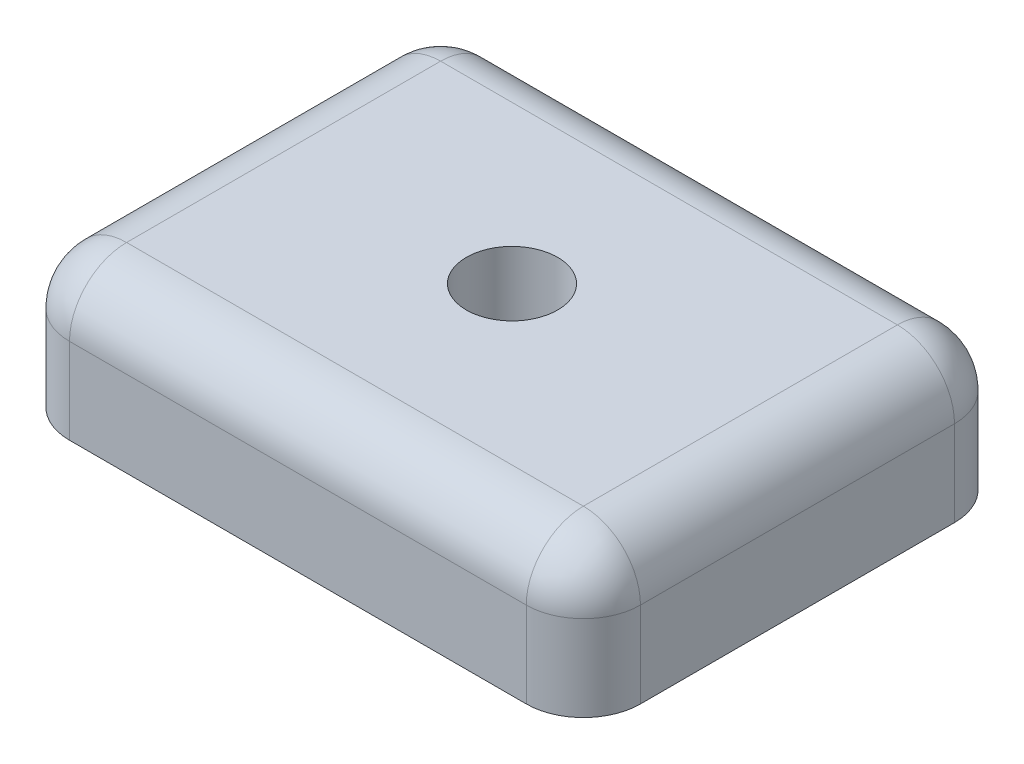
ISO-10303-21;
HEADER;
FILE_DESCRIPTION(('STEP AP214'),'2;1');
FILE_NAME('part.step','',(''),(''),'','','');
FILE_SCHEMA(('AUTOMOTIVE_DESIGN { 1 0 10303 214 1 1 1 1 }'));
ENDSEC;
DATA;
#1=APPLICATION_CONTEXT('core data for automotive mechanical design processes');
#2=APPLICATION_PROTOCOL_DEFINITION('international standard','automotive_design',2000,#1);
#3=PRODUCT_CONTEXT('',#1,'mechanical');
#4=PRODUCT('Part','Part','',(#3));
#5=PRODUCT_RELATED_PRODUCT_CATEGORY('part','',(#4));
#6=PRODUCT_DEFINITION_FORMATION('','',#4);
#7=PRODUCT_DEFINITION_CONTEXT('part definition',#1,'design');
#8=PRODUCT_DEFINITION('design','',#6,#7);
#9=PRODUCT_DEFINITION_SHAPE('','',#8);
#10=(LENGTH_UNIT() NAMED_UNIT(*) SI_UNIT(.MILLI.,.METRE.));
#11=(NAMED_UNIT(*) PLANE_ANGLE_UNIT() SI_UNIT($,.RADIAN.));
#12=(NAMED_UNIT(*) SI_UNIT($,.STERADIAN.) SOLID_ANGLE_UNIT());
#13=UNCERTAINTY_MEASURE_WITH_UNIT(LENGTH_MEASURE(1.E-05),#10,'distance_accuracy_value','');
#14=(GEOMETRIC_REPRESENTATION_CONTEXT(3) GLOBAL_UNCERTAINTY_ASSIGNED_CONTEXT((#13)) GLOBAL_UNIT_ASSIGNED_CONTEXT((#10,
#11,#12)) REPRESENTATION_CONTEXT('',''));
#15=CARTESIAN_POINT('',(0.,0.,0.));
#16=DIRECTION('',(0.,0.,1.));
#17=DIRECTION('',(1.,0.,0.));
#18=AXIS2_PLACEMENT_3D('',#15,#16,#17);
#19=CARTESIAN_POINT('',(0.,5.,0.));
#20=DIRECTION('',(0.,0.,-1.));
#21=DIRECTION('',(-1.,0.,0.));
#22=AXIS2_PLACEMENT_3D('',#19,#20,#21);
#23=PLANE('',#22);
#24=DIRECTION('',(1.,0.,0.));
#25=VECTOR('',#24,1.);
#26=CARTESIAN_POINT('',(0.,0.,0.));
#27=LINE('',#26,#25);
#28=CARTESIAN_POINT('',(2.,0.,0.));
#29=VERTEX_POINT('',#28);
#30=CARTESIAN_POINT('',(18.,0.,0.));
#31=VERTEX_POINT('',#30);
#32=EDGE_CURVE('E117',#29,#31,#27,.T.);
#33=ORIENTED_EDGE('',*,*,#32,.T.);
#34=DIRECTION('',(0.,-1.,0.));
#35=VECTOR('',#34,1.);
#36=CARTESIAN_POINT('',(18.,5.,0.));
#37=LINE('',#36,#35);
#38=CARTESIAN_POINT('',(18.,3.,0.));
#39=VERTEX_POINT('',#38);
#40=EDGE_CURVE('E162',#31,#39,#37,.F.);
#41=ORIENTED_EDGE('',*,*,#40,.T.);
#42=DIRECTION('',(1.,0.,0.));
#43=VECTOR('',#42,1.);
#44=CARTESIAN_POINT('',(0.,3.,0.));
#45=LINE('',#44,#43);
#46=CARTESIAN_POINT('',(2.,3.,0.));
#47=VERTEX_POINT('',#46);
#48=EDGE_CURVE('E158',#39,#47,#45,.F.);
#49=ORIENTED_EDGE('',*,*,#48,.T.);
#50=DIRECTION('',(0.,-1.,0.));
#51=VECTOR('',#50,1.);
#52=CARTESIAN_POINT('',(2.,0.,0.));
#53=LINE('',#52,#51);
#54=EDGE_CURVE('E160',#47,#29,#53,.T.);
#55=ORIENTED_EDGE('',*,*,#54,.T.);
#56=EDGE_LOOP('',(#33,#41,#49,#55));
#57=FACE_BOUND('',#56,.T.);
#58=ADVANCED_FACE('F35',(#57),#23,.F.);
#59=CARTESIAN_POINT('',(20.,5.,0.));
#60=DIRECTION('',(-1.,0.,0.));
#61=DIRECTION('',(0.,0.,1.));
#62=AXIS2_PLACEMENT_3D('',#59,#60,#61);
#63=PLANE('',#62);
#64=DIRECTION('',(0.,0.,-1.));
#65=VECTOR('',#64,1.);
#66=CARTESIAN_POINT('',(20.,0.,0.));
#67=LINE('',#66,#65);
#68=CARTESIAN_POINT('',(20.,0.,-2.));
#69=VERTEX_POINT('',#68);
#70=CARTESIAN_POINT('',(20.,0.,-13.));
#71=VERTEX_POINT('',#70);
#72=EDGE_CURVE('E212',#69,#71,#67,.T.);
#73=ORIENTED_EDGE('',*,*,#72,.T.);
#74=DIRECTION('',(0.,-1.,0.));
#75=VECTOR('',#74,1.);
#76=CARTESIAN_POINT('',(20.,5.,-13.));
#77=LINE('',#76,#75);
#78=CARTESIAN_POINT('',(20.,3.,-13.));
#79=VERTEX_POINT('',#78);
#80=EDGE_CURVE('E156',#71,#79,#77,.F.);
#81=ORIENTED_EDGE('',*,*,#80,.T.);
#82=DIRECTION('',(0.,0.,-1.));
#83=VECTOR('',#82,1.);
#84=CARTESIAN_POINT('',(20.,3.,0.));
#85=LINE('',#84,#83);
#86=CARTESIAN_POINT('',(20.,3.,-2.));
#87=VERTEX_POINT('',#86);
#88=EDGE_CURVE('E152',#79,#87,#85,.F.);
#89=ORIENTED_EDGE('',*,*,#88,.T.);
#90=DIRECTION('',(0.,-1.,0.));
#91=VECTOR('',#90,1.);
#92=CARTESIAN_POINT('',(20.,5.,-2.));
#93=LINE('',#92,#91);
#94=EDGE_CURVE('E154',#87,#69,#93,.T.);
#95=ORIENTED_EDGE('',*,*,#94,.T.);
#96=EDGE_LOOP('',(#73,#81,#89,#95));
#97=FACE_BOUND('',#96,.T.);
#98=ADVANCED_FACE('F227',(#97),#63,.F.);
#99=CARTESIAN_POINT('',(0.,5.,-15.));
#100=DIRECTION('',(0.,0.,-1.));
#101=DIRECTION('',(-1.,0.,0.));
#102=AXIS2_PLACEMENT_3D('',#99,#100,#101);
#103=PLANE('',#102);
#104=DIRECTION('',(1.,0.,0.));
#105=VECTOR('',#104,1.);
#106=CARTESIAN_POINT('',(0.,0.,-15.));
#107=LINE('',#106,#105);
#108=CARTESIAN_POINT('',(2.,0.,-15.));
#109=VERTEX_POINT('',#108);
#110=CARTESIAN_POINT('',(18.,0.,-15.));
#111=VERTEX_POINT('',#110);
#112=EDGE_CURVE('E131',#109,#111,#107,.T.);
#113=ORIENTED_EDGE('',*,*,#112,.F.);
#114=DIRECTION('',(0.,-1.,0.));
#115=VECTOR('',#114,1.);
#116=CARTESIAN_POINT('',(2.,5.,-15.));
#117=LINE('',#116,#115);
#118=CARTESIAN_POINT('',(2.,3.,-15.));
#119=VERTEX_POINT('',#118);
#120=EDGE_CURVE('E150',#109,#119,#117,.F.);
#121=ORIENTED_EDGE('',*,*,#120,.T.);
#122=DIRECTION('',(1.,0.,0.));
#123=VECTOR('',#122,1.);
#124=CARTESIAN_POINT('',(0.,3.,-15.));
#125=LINE('',#124,#123);
#126=CARTESIAN_POINT('',(18.,3.,-15.));
#127=VERTEX_POINT('',#126);
#128=EDGE_CURVE('E146',#119,#127,#125,.T.);
#129=ORIENTED_EDGE('',*,*,#128,.T.);
#130=DIRECTION('',(0.,-1.,0.));
#131=VECTOR('',#130,1.);
#132=CARTESIAN_POINT('',(18.,0.,-15.));
#133=LINE('',#132,#131);
#134=EDGE_CURVE('E148',#127,#111,#133,.T.);
#135=ORIENTED_EDGE('',*,*,#134,.T.);
#136=EDGE_LOOP('',(#113,#121,#129,#135));
#137=FACE_BOUND('',#136,.T.);
#138=ADVANCED_FACE('F268',(#137),#103,.T.);
#139=CARTESIAN_POINT('',(0.,5.,0.));
#140=DIRECTION('',(-1.,0.,0.));
#141=DIRECTION('',(0.,0.,1.));
#142=AXIS2_PLACEMENT_3D('',#139,#140,#141);
#143=PLANE('',#142);
#144=DIRECTION('',(0.,0.,-1.));
#145=VECTOR('',#144,1.);
#146=CARTESIAN_POINT('',(0.,3.,0.));
#147=LINE('',#146,#145);
#148=CARTESIAN_POINT('',(0.,3.,-2.));
#149=VERTEX_POINT('',#148);
#150=CARTESIAN_POINT('',(0.,3.,-13.));
#151=VERTEX_POINT('',#150);
#152=EDGE_CURVE('E130',#149,#151,#147,.T.);
#153=ORIENTED_EDGE('',*,*,#152,.T.);
#154=DIRECTION('',(0.,-1.,0.));
#155=VECTOR('',#154,1.);
#156=CARTESIAN_POINT('',(0.,5.,-13.));
#157=LINE('',#156,#155);
#158=CARTESIAN_POINT('',(0.,0.,-13.));
#159=VERTEX_POINT('',#158);
#160=EDGE_CURVE('E122',#151,#159,#157,.T.);
#161=ORIENTED_EDGE('',*,*,#160,.T.);
#162=DIRECTION('',(0.,0.,-1.));
#163=VECTOR('',#162,1.);
#164=CARTESIAN_POINT('',(0.,0.,0.));
#165=LINE('',#164,#163);
#166=CARTESIAN_POINT('',(0.,0.,-2.));
#167=VERTEX_POINT('',#166);
#168=EDGE_CURVE('E115',#167,#159,#165,.T.);
#169=ORIENTED_EDGE('',*,*,#168,.F.);
#170=DIRECTION('',(0.,-1.,0.));
#171=VECTOR('',#170,1.);
#172=CARTESIAN_POINT('',(0.,5.,-2.));
#173=LINE('',#172,#171);
#174=EDGE_CURVE('E127',#167,#149,#173,.F.);
#175=ORIENTED_EDGE('',*,*,#174,.T.);
#176=EDGE_LOOP('',(#153,#161,#169,#175));
#177=FACE_BOUND('',#176,.T.);
#178=ADVANCED_FACE('F126',(#177),#143,.T.);
#179=CARTESIAN_POINT('',(0.,5.,0.));
#180=DIRECTION('',(0.,1.,0.));
#181=DIRECTION('',(0.,0.,1.));
#182=AXIS2_PLACEMENT_3D('',#179,#180,#181);
#183=PLANE('',#182);
#184=DIRECTION('',(0.,0.,-1.));
#185=VECTOR('',#184,1.);
#186=CARTESIAN_POINT('',(2.,5.,0.));
#187=LINE('',#186,#185);
#188=CARTESIAN_POINT('',(2.,5.,-13.));
#189=VERTEX_POINT('',#188);
#190=CARTESIAN_POINT('',(2.,5.,-2.));
#191=VERTEX_POINT('',#190);
#192=EDGE_CURVE('E164',#189,#191,#187,.F.);
#193=ORIENTED_EDGE('',*,*,#192,.T.);
#194=DIRECTION('',(1.,0.,0.));
#195=VECTOR('',#194,1.);
#196=CARTESIAN_POINT('',(20.,5.,-2.));
#197=LINE('',#196,#195);
#198=CARTESIAN_POINT('',(18.,5.,-2.));
#199=VERTEX_POINT('',#198);
#200=EDGE_CURVE('E11',#191,#199,#197,.T.);
#201=ORIENTED_EDGE('',*,*,#200,.T.);
#202=DIRECTION('',(0.,0.,-1.));
#203=VECTOR('',#202,1.);
#204=CARTESIAN_POINT('',(18.,5.,-15.));
#205=LINE('',#204,#203);
#206=CARTESIAN_POINT('',(18.,5.,-13.));
#207=VERTEX_POINT('',#206);
#208=EDGE_CURVE('E44',#199,#207,#205,.T.);
#209=ORIENTED_EDGE('',*,*,#208,.T.);
#210=DIRECTION('',(1.,0.,0.));
#211=VECTOR('',#210,1.);
#212=CARTESIAN_POINT('',(0.,5.,-13.));
#213=LINE('',#212,#211);
#214=EDGE_CURVE('E166',#207,#189,#213,.F.);
#215=ORIENTED_EDGE('',*,*,#214,.T.);
#216=EDGE_LOOP('',(#193,#201,#209,#215));
#217=FACE_BOUND('',#216,.T.);
#218=CARTESIAN_POINT('',(10.,5.,-7.5));
#219=DIRECTION('',(0.,1.,0.));
#220=DIRECTION('',(0.,0.,1.));
#221=AXIS2_PLACEMENT_3D('',#218,#219,#220);
#222=CIRCLE('',#221,1.6);
#223=CARTESIAN_POINT('',(10.,5.,-5.9));
#224=VERTEX_POINT('',#223);
#225=EDGE_CURVE('E199',#224,#224,#222,.T.);
#226=ORIENTED_EDGE('',*,*,#225,.F.);
#227=EDGE_LOOP('',(#226));
#228=FACE_BOUND('',#227,.T.);
#229=ADVANCED_FACE('F239',(#217,#228),#183,.T.);
#230=CARTESIAN_POINT('',(0.,0.,0.));
#231=DIRECTION('',(0.,1.,0.));
#232=DIRECTION('',(0.,0.,1.));
#233=AXIS2_PLACEMENT_3D('',#230,#231,#232);
#234=PLANE('',#233);
#235=CARTESIAN_POINT('',(10.,0.,-7.5));
#236=DIRECTION('',(0.,1.,0.));
#237=DIRECTION('',(0.,0.,1.));
#238=AXIS2_PLACEMENT_3D('',#235,#236,#237);
#239=CIRCLE('',#238,1.6);
#240=CARTESIAN_POINT('',(10.,0.,-5.9));
#241=VERTEX_POINT('',#240);
#242=EDGE_CURVE('E204',#241,#241,#239,.T.);
#243=ORIENTED_EDGE('',*,*,#242,.T.);
#244=EDGE_LOOP('',(#243));
#245=FACE_BOUND('',#244,.T.);
#246=ORIENTED_EDGE('',*,*,#168,.T.);
#247=CARTESIAN_POINT('',(2.,0.,-13.));
#248=DIRECTION('',(0.,1.,0.));
#249=DIRECTION('',(0.,0.,1.));
#250=AXIS2_PLACEMENT_3D('',#247,#248,#249);
#251=CIRCLE('',#250,2.);
#252=EDGE_CURVE('E144',#159,#109,#251,.F.);
#253=ORIENTED_EDGE('',*,*,#252,.T.);
#254=ORIENTED_EDGE('',*,*,#112,.T.);
#255=CARTESIAN_POINT('',(18.,0.,-13.));
#256=DIRECTION('',(0.,1.,0.));
#257=DIRECTION('',(0.,0.,1.));
#258=AXIS2_PLACEMENT_3D('',#255,#256,#257);
#259=CIRCLE('',#258,2.);
#260=EDGE_CURVE('E142',#111,#71,#259,.F.);
#261=ORIENTED_EDGE('',*,*,#260,.T.);
#262=ORIENTED_EDGE('',*,*,#72,.F.);
#263=CARTESIAN_POINT('',(18.,0.,-2.));
#264=DIRECTION('',(0.,1.,0.));
#265=DIRECTION('',(0.,0.,1.));
#266=AXIS2_PLACEMENT_3D('',#263,#264,#265);
#267=CIRCLE('',#266,2.);
#268=EDGE_CURVE('E121',#69,#31,#267,.F.);
#269=ORIENTED_EDGE('',*,*,#268,.T.);
#270=ORIENTED_EDGE('',*,*,#32,.F.);
#271=CARTESIAN_POINT('',(2.,0.,-2.));
#272=DIRECTION('',(0.,1.,0.));
#273=DIRECTION('',(0.,0.,1.));
#274=AXIS2_PLACEMENT_3D('',#271,#272,#273);
#275=CIRCLE('',#274,2.);
#276=EDGE_CURVE('E112',#29,#167,#275,.F.);
#277=ORIENTED_EDGE('',*,*,#276,.T.);
#278=EDGE_LOOP('',(#246,#253,#254,#261,#262,#269,#270,#277));
#279=FACE_BOUND('',#278,.T.);
#280=ADVANCED_FACE('F114',(#245,#279),#234,.F.);
#281=CARTESIAN_POINT('',(10.,0.,-7.5));
#282=DIRECTION('',(0.,1.,0.));
#283=DIRECTION('',(0.,0.,1.));
#284=AXIS2_PLACEMENT_3D('',#281,#282,#283);
#285=CYLINDRICAL_SURFACE('',#284,1.6);
#286=ORIENTED_EDGE('',*,*,#242,.F.);
#287=EDGE_LOOP('',(#286));
#288=FACE_BOUND('',#287,.T.);
#289=ORIENTED_EDGE('',*,*,#225,.T.);
#290=EDGE_LOOP('',(#289));
#291=FACE_BOUND('',#290,.T.);
#292=ADVANCED_FACE('F260',(#288,#291),#285,.F.);
#293=CARTESIAN_POINT('',(18.,5.,-2.));
#294=DIRECTION('',(0.,-1.,0.));
#295=DIRECTION('',(0.,0.,-1.));
#296=AXIS2_PLACEMENT_3D('',#293,#294,#295);
#297=CYLINDRICAL_SURFACE('',#296,2.);
#298=CARTESIAN_POINT('',(18.,3.,-2.));
#299=DIRECTION('',(0.,1.,0.));
#300=DIRECTION('',(0.,0.,1.));
#301=AXIS2_PLACEMENT_3D('',#298,#299,#300);
#302=CIRCLE('',#301,2.);
#303=EDGE_CURVE('E39',#39,#87,#302,.T.);
#304=ORIENTED_EDGE('',*,*,#303,.F.);
#305=ORIENTED_EDGE('',*,*,#40,.F.);
#306=ORIENTED_EDGE('',*,*,#268,.F.);
#307=ORIENTED_EDGE('',*,*,#94,.F.);
#308=EDGE_LOOP('',(#304,#305,#306,#307));
#309=FACE_BOUND('',#308,.T.);
#310=ADVANCED_FACE('F37',(#309),#297,.T.);
#311=CARTESIAN_POINT('',(18.,3.,-2.));
#312=DIRECTION('',(1.,0.,0.));
#313=DIRECTION('',(0.,0.,-1.));
#314=AXIS2_PLACEMENT_3D('',#311,#312,#313);
#315=SPHERICAL_SURFACE('',#314,2.);
#316=CARTESIAN_POINT('',(18.,3.,-2.));
#317=DIRECTION('',(1.,0.,0.));
#318=DIRECTION('',(0.,0.,-1.));
#319=AXIS2_PLACEMENT_3D('',#316,#317,#318);
#320=CIRCLE('',#319,2.);
#321=EDGE_CURVE('E194',#39,#199,#320,.F.);
#322=ORIENTED_EDGE('',*,*,#321,.F.);
#323=ORIENTED_EDGE('',*,*,#303,.T.);
#324=CARTESIAN_POINT('',(18.,3.,-2.));
#325=DIRECTION('',(0.,0.,1.));
#326=DIRECTION('',(0.,-1.,0.));
#327=AXIS2_PLACEMENT_3D('',#324,#325,#326);
#328=CIRCLE('',#327,2.);
#329=EDGE_CURVE('E196',#199,#87,#328,.F.);
#330=ORIENTED_EDGE('',*,*,#329,.F.);
#331=EDGE_LOOP('',(#322,#323,#330));
#332=FACE_BOUND('',#331,.T.);
#333=ADVANCED_FACE('F253',(#332),#315,.T.);
#334=CARTESIAN_POINT('',(18.,5.,-13.));
#335=DIRECTION('',(0.,1.,0.));
#336=DIRECTION('',(0.,0.,1.));
#337=AXIS2_PLACEMENT_3D('',#334,#335,#336);
#338=CYLINDRICAL_SURFACE('',#337,2.);
#339=ORIENTED_EDGE('',*,*,#260,.F.);
#340=ORIENTED_EDGE('',*,*,#134,.F.);
#341=CARTESIAN_POINT('',(18.,3.,-13.));
#342=DIRECTION('',(0.,1.,0.));
#343=DIRECTION('',(0.,0.,1.));
#344=AXIS2_PLACEMENT_3D('',#341,#342,#343);
#345=CIRCLE('',#344,2.);
#346=EDGE_CURVE('E191',#79,#127,#345,.T.);
#347=ORIENTED_EDGE('',*,*,#346,.F.);
#348=ORIENTED_EDGE('',*,*,#80,.F.);
#349=EDGE_LOOP('',(#339,#340,#347,#348));
#350=FACE_BOUND('',#349,.T.);
#351=ADVANCED_FACE('F224',(#350),#338,.T.);
#352=CARTESIAN_POINT('',(18.,3.,0.));
#353=DIRECTION('',(0.,0.,1.));
#354=DIRECTION('',(1.,0.,0.));
#355=AXIS2_PLACEMENT_3D('',#352,#353,#354);
#356=CYLINDRICAL_SURFACE('',#355,2.);
#357=ORIENTED_EDGE('',*,*,#329,.T.);
#358=ORIENTED_EDGE('',*,*,#88,.F.);
#359=CARTESIAN_POINT('',(18.,3.,-13.));
#360=DIRECTION('',(0.,0.,-1.));
#361=DIRECTION('',(-1.,0.,0.));
#362=AXIS2_PLACEMENT_3D('',#359,#360,#361);
#363=CIRCLE('',#362,2.);
#364=EDGE_CURVE('E188',#207,#79,#363,.T.);
#365=ORIENTED_EDGE('',*,*,#364,.F.);
#366=ORIENTED_EDGE('',*,*,#208,.F.);
#367=EDGE_LOOP('',(#357,#358,#365,#366));
#368=FACE_BOUND('',#367,.T.);
#369=ADVANCED_FACE('F229',(#368),#356,.T.);
#370=CARTESIAN_POINT('',(0.,3.,-2.));
#371=DIRECTION('',(-1.,0.,0.));
#372=DIRECTION('',(0.,0.,1.));
#373=AXIS2_PLACEMENT_3D('',#370,#371,#372);
#374=CYLINDRICAL_SURFACE('',#373,2.);
#375=ORIENTED_EDGE('',*,*,#321,.T.);
#376=ORIENTED_EDGE('',*,*,#200,.F.);
#377=CARTESIAN_POINT('',(2.,3.,-2.));
#378=DIRECTION('',(-1.,0.,0.));
#379=DIRECTION('',(0.,0.,1.));
#380=AXIS2_PLACEMENT_3D('',#377,#378,#379);
#381=CIRCLE('',#380,2.);
#382=EDGE_CURVE('E185',#47,#191,#381,.T.);
#383=ORIENTED_EDGE('',*,*,#382,.F.);
#384=ORIENTED_EDGE('',*,*,#48,.F.);
#385=EDGE_LOOP('',(#375,#376,#383,#384));
#386=FACE_BOUND('',#385,.T.);
#387=ADVANCED_FACE('F252',(#386),#374,.T.);
#388=CARTESIAN_POINT('',(2.,5.,-2.));
#389=DIRECTION('',(0.,1.,0.));
#390=DIRECTION('',(0.,0.,1.));
#391=AXIS2_PLACEMENT_3D('',#388,#389,#390);
#392=CYLINDRICAL_SURFACE('',#391,2.);
#393=ORIENTED_EDGE('',*,*,#276,.F.);
#394=ORIENTED_EDGE('',*,*,#54,.F.);
#395=CARTESIAN_POINT('',(2.,3.,-2.));
#396=DIRECTION('',(0.,1.,0.));
#397=DIRECTION('',(0.,0.,1.));
#398=AXIS2_PLACEMENT_3D('',#395,#396,#397);
#399=CIRCLE('',#398,2.);
#400=EDGE_CURVE('E135',#149,#47,#399,.T.);
#401=ORIENTED_EDGE('',*,*,#400,.F.);
#402=ORIENTED_EDGE('',*,*,#174,.F.);
#403=EDGE_LOOP('',(#393,#394,#401,#402));
#404=FACE_BOUND('',#403,.T.);
#405=ADVANCED_FACE('F133',(#404),#392,.T.);
#406=CARTESIAN_POINT('',(18.,3.,-13.));
#407=DIRECTION('',(1.,0.,0.));
#408=DIRECTION('',(0.,0.,-1.));
#409=AXIS2_PLACEMENT_3D('',#406,#407,#408);
#410=SPHERICAL_SURFACE('',#409,2.);
#411=ORIENTED_EDGE('',*,*,#364,.T.);
#412=ORIENTED_EDGE('',*,*,#346,.T.);
#413=CARTESIAN_POINT('',(18.,3.,-13.));
#414=DIRECTION('',(1.,0.,0.));
#415=DIRECTION('',(0.,0.,-1.));
#416=AXIS2_PLACEMENT_3D('',#413,#414,#415);
#417=CIRCLE('',#416,2.);
#418=EDGE_CURVE('E181',#207,#127,#417,.F.);
#419=ORIENTED_EDGE('',*,*,#418,.F.);
#420=EDGE_LOOP('',(#411,#412,#419));
#421=FACE_BOUND('',#420,.T.);
#422=ADVANCED_FACE('F233',(#421),#410,.T.);
#423=CARTESIAN_POINT('',(2.,3.,-2.));
#424=DIRECTION('',(0.,0.,1.));
#425=DIRECTION('',(1.,0.,0.));
#426=AXIS2_PLACEMENT_3D('',#423,#424,#425);
#427=SPHERICAL_SURFACE('',#426,2.);
#428=ORIENTED_EDGE('',*,*,#400,.T.);
#429=ORIENTED_EDGE('',*,*,#382,.T.);
#430=CARTESIAN_POINT('',(2.,3.,-2.));
#431=DIRECTION('',(0.,0.,1.));
#432=DIRECTION('',(1.,0.,0.));
#433=AXIS2_PLACEMENT_3D('',#430,#431,#432);
#434=CIRCLE('',#433,2.);
#435=EDGE_CURVE('E178',#149,#191,#434,.F.);
#436=ORIENTED_EDGE('',*,*,#435,.F.);
#437=EDGE_LOOP('',(#428,#429,#436));
#438=FACE_BOUND('',#437,.T.);
#439=ADVANCED_FACE('F248',(#438),#427,.T.);
#440=CARTESIAN_POINT('',(0.,3.,-13.));
#441=DIRECTION('',(1.,0.,0.));
#442=DIRECTION('',(0.,0.,-1.));
#443=AXIS2_PLACEMENT_3D('',#440,#441,#442);
#444=CYLINDRICAL_SURFACE('',#443,2.);
#445=ORIENTED_EDGE('',*,*,#418,.T.);
#446=ORIENTED_EDGE('',*,*,#128,.F.);
#447=CARTESIAN_POINT('',(2.,3.,-13.));
#448=DIRECTION('',(-1.,0.,0.));
#449=DIRECTION('',(0.,0.,1.));
#450=AXIS2_PLACEMENT_3D('',#447,#448,#449);
#451=CIRCLE('',#450,2.);
#452=EDGE_CURVE('E175',#189,#119,#451,.T.);
#453=ORIENTED_EDGE('',*,*,#452,.F.);
#454=ORIENTED_EDGE('',*,*,#214,.F.);
#455=EDGE_LOOP('',(#445,#446,#453,#454));
#456=FACE_BOUND('',#455,.T.);
#457=ADVANCED_FACE('F237',(#456),#444,.T.);
#458=CARTESIAN_POINT('',(2.,3.,0.));
#459=DIRECTION('',(0.,0.,-1.));
#460=DIRECTION('',(-1.,0.,0.));
#461=AXIS2_PLACEMENT_3D('',#458,#459,#460);
#462=CYLINDRICAL_SURFACE('',#461,2.);
#463=ORIENTED_EDGE('',*,*,#435,.T.);
#464=ORIENTED_EDGE('',*,*,#192,.F.);
#465=CARTESIAN_POINT('',(2.,3.,-13.));
#466=DIRECTION('',(0.,0.,-1.));
#467=DIRECTION('',(-1.,0.,0.));
#468=AXIS2_PLACEMENT_3D('',#465,#466,#467);
#469=CIRCLE('',#468,2.);
#470=EDGE_CURVE('E172',#151,#189,#469,.T.);
#471=ORIENTED_EDGE('',*,*,#470,.F.);
#472=ORIENTED_EDGE('',*,*,#152,.F.);
#473=EDGE_LOOP('',(#463,#464,#471,#472));
#474=FACE_BOUND('',#473,.T.);
#475=ADVANCED_FACE('F244',(#474),#462,.T.);
#476=CARTESIAN_POINT('',(2.,3.,-13.));
#477=DIRECTION('',(0.,1.,0.));
#478=DIRECTION('',(0.,0.,1.));
#479=AXIS2_PLACEMENT_3D('',#476,#477,#478);
#480=SPHERICAL_SURFACE('',#479,2.);
#481=ORIENTED_EDGE('',*,*,#470,.T.);
#482=ORIENTED_EDGE('',*,*,#452,.T.);
#483=CARTESIAN_POINT('',(2.,3.,-13.));
#484=DIRECTION('',(0.,1.,0.));
#485=DIRECTION('',(0.,0.,1.));
#486=AXIS2_PLACEMENT_3D('',#483,#484,#485);
#487=CIRCLE('',#486,2.);
#488=EDGE_CURVE('E169',#151,#119,#487,.F.);
#489=ORIENTED_EDGE('',*,*,#488,.F.);
#490=EDGE_LOOP('',(#481,#482,#489));
#491=FACE_BOUND('',#490,.T.);
#492=ADVANCED_FACE('F275',(#491),#480,.T.);
#493=CARTESIAN_POINT('',(2.,5.,-13.));
#494=DIRECTION('',(0.,-1.,0.));
#495=DIRECTION('',(0.,0.,-1.));
#496=AXIS2_PLACEMENT_3D('',#493,#494,#495);
#497=CYLINDRICAL_SURFACE('',#496,2.);
#498=ORIENTED_EDGE('',*,*,#488,.T.);
#499=ORIENTED_EDGE('',*,*,#120,.F.);
#500=ORIENTED_EDGE('',*,*,#252,.F.);
#501=ORIENTED_EDGE('',*,*,#160,.F.);
#502=EDGE_LOOP('',(#498,#499,#500,#501));
#503=FACE_BOUND('',#502,.T.);
#504=ADVANCED_FACE('F272',(#503),#497,.T.);
#505=CLOSED_SHELL('',(#58,#98,#138,#178,#229,#280,#292,#310,#333,#351,#369,#387,#405,#422,#439,
#457,#475,#492,#504));
#506=MANIFOLD_SOLID_BREP('B2',#505);
#507=ADVANCED_BREP_SHAPE_REPRESENTATION('',(#18,#506),#14);
#508=SHAPE_DEFINITION_REPRESENTATION(#9,#507);
ENDSEC;
END-ISO-10303-21;
